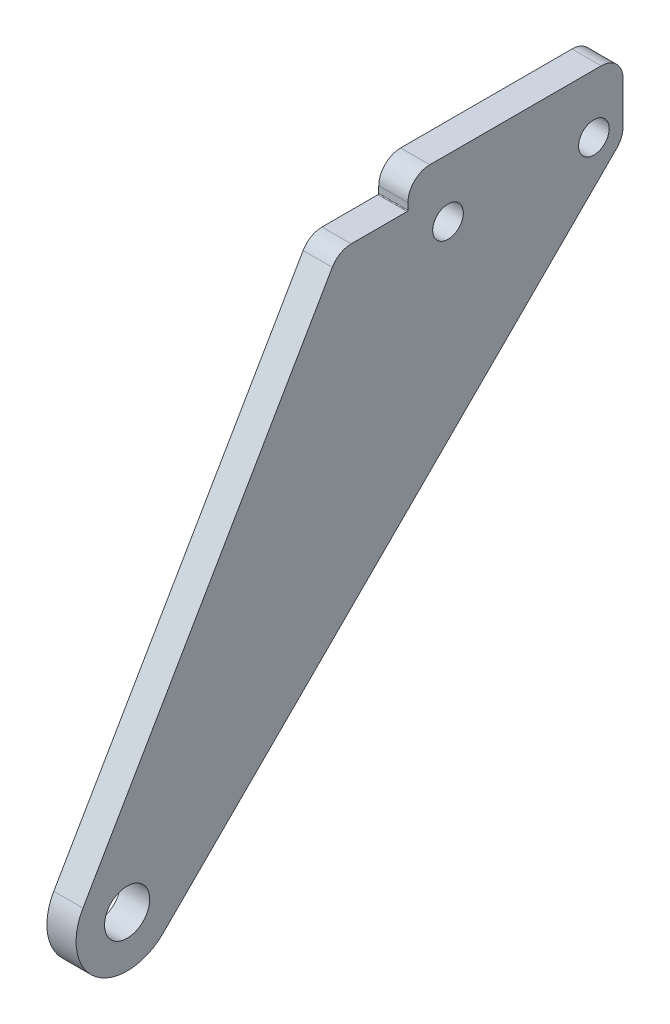
ISO-10303-21;
HEADER;
FILE_DESCRIPTION(('STEP AP214'),'2;1');
FILE_NAME('part.step','',(''),(''),'','','');
FILE_SCHEMA(('AUTOMOTIVE_DESIGN { 1 0 10303 214 1 1 1 1 }'));
ENDSEC;
DATA;
#1=APPLICATION_CONTEXT('core data for automotive mechanical design processes');
#2=APPLICATION_PROTOCOL_DEFINITION('international standard','automotive_design',2000,#1);
#3=PRODUCT_CONTEXT('',#1,'mechanical');
#4=PRODUCT('Part','Part','',(#3));
#5=PRODUCT_RELATED_PRODUCT_CATEGORY('part','',(#4));
#6=PRODUCT_DEFINITION_FORMATION('','',#4);
#7=PRODUCT_DEFINITION_CONTEXT('part definition',#1,'design');
#8=PRODUCT_DEFINITION('design','',#6,#7);
#9=PRODUCT_DEFINITION_SHAPE('','',#8);
#10=(LENGTH_UNIT() NAMED_UNIT(*) SI_UNIT(.MILLI.,.METRE.));
#11=(NAMED_UNIT(*) PLANE_ANGLE_UNIT() SI_UNIT($,.RADIAN.));
#12=(NAMED_UNIT(*) SI_UNIT($,.STERADIAN.) SOLID_ANGLE_UNIT());
#13=UNCERTAINTY_MEASURE_WITH_UNIT(LENGTH_MEASURE(1.E-05),#10,'distance_accuracy_value','');
#14=(GEOMETRIC_REPRESENTATION_CONTEXT(3) GLOBAL_UNCERTAINTY_ASSIGNED_CONTEXT((#13)) GLOBAL_UNIT_ASSIGNED_CONTEXT((#10,
#11,#12)) REPRESENTATION_CONTEXT('',''));
#15=CARTESIAN_POINT('',(0.,0.,0.));
#16=DIRECTION('',(0.,0.,1.));
#17=DIRECTION('',(1.,0.,0.));
#18=AXIS2_PLACEMENT_3D('',#15,#16,#17);
#19=CARTESIAN_POINT('',(4.,64.,-29.));
#20=DIRECTION('',(0.,-1.,0.));
#21=DIRECTION('',(0.,0.,-1.));
#22=AXIS2_PLACEMENT_3D('',#19,#20,#21);
#23=PLANE('',#22);
#24=DIRECTION('',(0.,0.,1.));
#25=VECTOR('',#24,1.);
#26=CARTESIAN_POINT('',(4.,64.,-29.));
#27=LINE('',#26,#25);
#28=CARTESIAN_POINT('',(4.,64.,-38.4));
#29=VERTEX_POINT('',#28);
#30=CARTESIAN_POINT('',(4.,64.,-30.7287704157096));
#31=VERTEX_POINT('',#30);
#32=EDGE_CURVE('E131',#29,#31,#27,.T.);
#33=ORIENTED_EDGE('',*,*,#32,.F.);
#34=DIRECTION('',(1.,0.,0.));
#35=VECTOR('',#34,1.);
#36=CARTESIAN_POINT('',(4.,64.,-38.4));
#37=LINE('',#36,#35);
#38=CARTESIAN_POINT('',(0.,64.,-38.4));
#39=VERTEX_POINT('',#38);
#40=EDGE_CURVE('E55',#29,#39,#37,.F.);
#41=ORIENTED_EDGE('',*,*,#40,.T.);
#42=DIRECTION('',(0.,0.,1.));
#43=VECTOR('',#42,1.);
#44=CARTESIAN_POINT('',(0.,64.,-29.));
#45=LINE('',#44,#43);
#46=CARTESIAN_POINT('',(0.,64.,-30.7287704157096));
#47=VERTEX_POINT('',#46);
#48=EDGE_CURVE('E235',#39,#47,#45,.T.);
#49=ORIENTED_EDGE('',*,*,#48,.T.);
#50=DIRECTION('',(-1.,0.,0.));
#51=VECTOR('',#50,1.);
#52=CARTESIAN_POINT('',(4.,64.,-30.7287704157096));
#53=LINE('',#52,#51);
#54=EDGE_CURVE('E181',#47,#31,#53,.F.);
#55=ORIENTED_EDGE('',*,*,#54,.T.);
#56=EDGE_LOOP('',(#33,#41,#49,#55));
#57=FACE_BOUND('',#56,.T.);
#58=ADVANCED_FACE('F34',(#57),#23,.F.);
#59=CARTESIAN_POINT('',(4.,0.,0.));
#60=DIRECTION('',(1.,0.,0.));
#61=DIRECTION('',(0.,0.,-1.));
#62=AXIS2_PLACEMENT_3D('',#59,#60,#61);
#63=PLANE('',#62);
#64=DIRECTION('',(0.,0.,1.));
#65=VECTOR('',#64,1.);
#66=CARTESIAN_POINT('',(4.,68.,-74.));
#67=LINE('',#66,#65);
#68=CARTESIAN_POINT('',(4.,68.,-65.));
#69=VERTEX_POINT('',#68);
#70=CARTESIAN_POINT('',(4.,68.,-41.5));
#71=VERTEX_POINT('',#70);
#72=EDGE_CURVE('E203',#69,#71,#67,.T.);
#73=ORIENTED_EDGE('',*,*,#72,.T.);
#74=CARTESIAN_POINT('',(4.,65.,-41.5));
#75=DIRECTION('',(1.,0.,0.));
#76=DIRECTION('',(0.,0.,-1.));
#77=AXIS2_PLACEMENT_3D('',#74,#75,#76);
#78=CIRCLE('',#77,3.);
#79=CARTESIAN_POINT('',(4.,65.,-38.5));
#80=VERTEX_POINT('',#79);
#81=EDGE_CURVE('E164',#71,#80,#78,.T.);
#82=ORIENTED_EDGE('',*,*,#81,.T.);
#83=DIRECTION('',(0.,-1.,0.));
#84=VECTOR('',#83,1.);
#85=CARTESIAN_POINT('',(4.,64.,-38.5));
#86=LINE('',#85,#84);
#87=CARTESIAN_POINT('',(4.,64.1,-38.5));
#88=VERTEX_POINT('',#87);
#89=EDGE_CURVE('E198',#80,#88,#86,.T.);
#90=ORIENTED_EDGE('',*,*,#89,.T.);
#91=CARTESIAN_POINT('',(4.,64.1,-38.4));
#92=DIRECTION('',(1.,0.,0.));
#93=DIRECTION('',(0.,0.,-1.));
#94=AXIS2_PLACEMENT_3D('',#91,#92,#93);
#95=CIRCLE('',#94,0.1);
#96=EDGE_CURVE('E42',#88,#29,#95,.F.);
#97=ORIENTED_EDGE('',*,*,#96,.T.);
#98=ORIENTED_EDGE('',*,*,#32,.T.);
#99=CARTESIAN_POINT('',(4.,61.,-30.7287704157096));
#100=DIRECTION('',(1.,0.,0.));
#101=DIRECTION('',(0.,0.,-1.));
#102=AXIS2_PLACEMENT_3D('',#99,#100,#101);
#103=CIRCLE('',#102,3.);
#104=CARTESIAN_POINT('',(4.,62.5042613502018,-28.1331591600919));
#105=VERTEX_POINT('',#104);
#106=EDGE_CURVE('E162',#31,#105,#103,.T.);
#107=ORIENTED_EDGE('',*,*,#106,.T.);
#108=DIRECTION('',(0.,-0.865203751872559,0.501420450067253));
#109=VECTOR('',#108,1.);
#110=CARTESIAN_POINT('',(4.,3.50994315047077,6.05642626310791));
#111=LINE('',#110,#109);
#112=CARTESIAN_POINT('',(4.,3.50994315047077,6.05642626310791));
#113=VERTEX_POINT('',#112);
#114=EDGE_CURVE('E139',#105,#113,#111,.T.);
#115=ORIENTED_EDGE('',*,*,#114,.T.);
#116=CARTESIAN_POINT('',(4.,0.,0.));
#117=DIRECTION('',(1.,0.,0.));
#118=DIRECTION('',(0.,0.,-1.));
#119=AXIS2_PLACEMENT_3D('',#116,#117,#118);
#120=CIRCLE('',#119,7.);
#121=CARTESIAN_POINT('',(4.,-4.95335094954734,-4.94614136177067));
#122=VERTEX_POINT('',#121);
#123=EDGE_CURVE('E132',#113,#122,#120,.T.);
#124=ORIENTED_EDGE('',*,*,#123,.T.);
#125=DIRECTION('',(0.,0.706591623110095,-0.707621564221047));
#126=VECTOR('',#125,1.);
#127=CARTESIAN_POINT('',(4.,64.,-74.));
#128=LINE('',#127,#126);
#129=CARTESIAN_POINT('',(4.,57.1297890168252,-67.1197748693303));
#130=VERTEX_POINT('',#129);
#131=EDGE_CURVE('E122',#122,#130,#128,.T.);
#132=ORIENTED_EDGE('',*,*,#131,.T.);
#133=CARTESIAN_POINT('',(4.,59.2526537094883,-65.));
#134=DIRECTION('',(1.,0.,0.));
#135=DIRECTION('',(0.,0.,-1.));
#136=AXIS2_PLACEMENT_3D('',#133,#134,#135);
#137=CIRCLE('',#136,3.);
#138=CARTESIAN_POINT('',(4.,59.2526537094883,-68.));
#139=VERTEX_POINT('',#138);
#140=EDGE_CURVE('E160',#130,#139,#137,.T.);
#141=ORIENTED_EDGE('',*,*,#140,.T.);
#142=DIRECTION('',(0.,-1.,0.));
#143=VECTOR('',#142,1.);
#144=CARTESIAN_POINT('',(4.,68.,-68.));
#145=LINE('',#144,#143);
#146=CARTESIAN_POINT('',(4.,65.,-68.));
#147=VERTEX_POINT('',#146);
#148=EDGE_CURVE('E250',#147,#139,#145,.T.);
#149=ORIENTED_EDGE('',*,*,#148,.F.);
#150=CARTESIAN_POINT('',(4.,65.,-65.));
#151=DIRECTION('',(1.,0.,0.));
#152=DIRECTION('',(0.,0.,-1.));
#153=AXIS2_PLACEMENT_3D('',#150,#151,#152);
#154=CIRCLE('',#153,3.);
#155=EDGE_CURVE('E158',#147,#69,#154,.T.);
#156=ORIENTED_EDGE('',*,*,#155,.T.);
#157=EDGE_LOOP('',(#73,#82,#90,#97,#98,#107,#115,#124,#132,#141,#149,#156));
#158=FACE_BOUND('',#157,.T.);
#159=CARTESIAN_POINT('',(4.,60.,-44.));
#160=DIRECTION('',(1.,0.,0.));
#161=DIRECTION('',(0.,0.,-1.));
#162=AXIS2_PLACEMENT_3D('',#159,#160,#161);
#163=CIRCLE('',#162,2.1);
#164=CARTESIAN_POINT('',(4.,60.,-46.1));
#165=VERTEX_POINT('',#164);
#166=EDGE_CURVE('E219',#165,#165,#163,.T.);
#167=ORIENTED_EDGE('',*,*,#166,.F.);
#168=EDGE_LOOP('',(#167));
#169=FACE_BOUND('',#168,.T.);
#170=CARTESIAN_POINT('',(4.,0.,0.));
#171=DIRECTION('',(1.,0.,0.));
#172=DIRECTION('',(0.,0.,-1.));
#173=AXIS2_PLACEMENT_3D('',#170,#171,#172);
#174=CIRCLE('',#173,3.1);
#175=CARTESIAN_POINT('',(4.,0.,-3.1));
#176=VERTEX_POINT('',#175);
#177=EDGE_CURVE('E225',#176,#176,#174,.T.);
#178=ORIENTED_EDGE('',*,*,#177,.F.);
#179=EDGE_LOOP('',(#178));
#180=FACE_BOUND('',#179,.T.);
#181=CARTESIAN_POINT('',(4.,60.,-64.));
#182=DIRECTION('',(1.,0.,0.));
#183=DIRECTION('',(0.,0.,-1.));
#184=AXIS2_PLACEMENT_3D('',#181,#182,#183);
#185=CIRCLE('',#184,2.09999999999999);
#186=CARTESIAN_POINT('',(4.,60.,-66.1));
#187=VERTEX_POINT('',#186);
#188=EDGE_CURVE('E213',#187,#187,#185,.T.);
#189=ORIENTED_EDGE('',*,*,#188,.F.);
#190=EDGE_LOOP('',(#189));
#191=FACE_BOUND('',#190,.T.);
#192=ADVANCED_FACE('F136',(#158,#169,#180,#191),#63,.T.);
#193=CARTESIAN_POINT('',(0.,0.,0.));
#194=DIRECTION('',(1.,0.,0.));
#195=DIRECTION('',(0.,0.,-1.));
#196=AXIS2_PLACEMENT_3D('',#193,#194,#195);
#197=PLANE('',#196);
#198=ORIENTED_EDGE('',*,*,#48,.F.);
#199=CARTESIAN_POINT('',(0.,64.1,-38.4));
#200=DIRECTION('',(1.,0.,0.));
#201=DIRECTION('',(0.,0.,-1.));
#202=AXIS2_PLACEMENT_3D('',#199,#200,#201);
#203=CIRCLE('',#202,0.1);
#204=CARTESIAN_POINT('',(0.,64.1,-38.5));
#205=VERTEX_POINT('',#204);
#206=EDGE_CURVE('E11',#39,#205,#203,.T.);
#207=ORIENTED_EDGE('',*,*,#206,.T.);
#208=DIRECTION('',(0.,1.,0.));
#209=VECTOR('',#208,1.);
#210=CARTESIAN_POINT('',(0.,64.,-38.5));
#211=LINE('',#210,#209);
#212=CARTESIAN_POINT('',(0.,65.,-38.5));
#213=VERTEX_POINT('',#212);
#214=EDGE_CURVE('E200',#205,#213,#211,.T.);
#215=ORIENTED_EDGE('',*,*,#214,.T.);
#216=CARTESIAN_POINT('',(0.,65.,-41.5));
#217=DIRECTION('',(1.,0.,0.));
#218=DIRECTION('',(0.,0.,-1.));
#219=AXIS2_PLACEMENT_3D('',#216,#217,#218);
#220=CIRCLE('',#219,3.);
#221=CARTESIAN_POINT('',(0.,68.,-41.5));
#222=VERTEX_POINT('',#221);
#223=EDGE_CURVE('E176',#213,#222,#220,.F.);
#224=ORIENTED_EDGE('',*,*,#223,.T.);
#225=DIRECTION('',(0.,0.,-1.));
#226=VECTOR('',#225,1.);
#227=CARTESIAN_POINT('',(0.,68.,-74.));
#228=LINE('',#227,#226);
#229=CARTESIAN_POINT('',(0.,68.,-65.));
#230=VERTEX_POINT('',#229);
#231=EDGE_CURVE('E205',#222,#230,#228,.T.);
#232=ORIENTED_EDGE('',*,*,#231,.T.);
#233=CARTESIAN_POINT('',(0.,65.,-65.));
#234=DIRECTION('',(1.,0.,0.));
#235=DIRECTION('',(0.,0.,-1.));
#236=AXIS2_PLACEMENT_3D('',#233,#234,#235);
#237=CIRCLE('',#236,3.);
#238=CARTESIAN_POINT('',(0.,65.,-68.));
#239=VERTEX_POINT('',#238);
#240=EDGE_CURVE('E169',#230,#239,#237,.F.);
#241=ORIENTED_EDGE('',*,*,#240,.T.);
#242=DIRECTION('',(0.,-1.,0.));
#243=VECTOR('',#242,1.);
#244=CARTESIAN_POINT('',(0.,68.,-68.));
#245=LINE('',#244,#243);
#246=CARTESIAN_POINT('',(0.,59.2526537094883,-68.));
#247=VERTEX_POINT('',#246);
#248=EDGE_CURVE('E207',#239,#247,#245,.T.);
#249=ORIENTED_EDGE('',*,*,#248,.T.);
#250=CARTESIAN_POINT('',(0.,59.2526537094883,-65.));
#251=DIRECTION('',(1.,0.,0.));
#252=DIRECTION('',(0.,0.,-1.));
#253=AXIS2_PLACEMENT_3D('',#250,#251,#252);
#254=CIRCLE('',#253,3.);
#255=CARTESIAN_POINT('',(0.,57.1297890168252,-67.1197748693303));
#256=VERTEX_POINT('',#255);
#257=EDGE_CURVE('E171',#247,#256,#254,.F.);
#258=ORIENTED_EDGE('',*,*,#257,.T.);
#259=DIRECTION('',(0.,0.706591623110095,-0.707621564221047));
#260=VECTOR('',#259,1.);
#261=CARTESIAN_POINT('',(0.,64.,-74.));
#262=LINE('',#261,#260);
#263=CARTESIAN_POINT('',(0.,-4.95335094954734,-4.94614136177067));
#264=VERTEX_POINT('',#263);
#265=EDGE_CURVE('E233',#264,#256,#262,.T.);
#266=ORIENTED_EDGE('',*,*,#265,.F.);
#267=CARTESIAN_POINT('',(0.,0.,0.));
#268=DIRECTION('',(1.,0.,0.));
#269=DIRECTION('',(0.,0.,-1.));
#270=AXIS2_PLACEMENT_3D('',#267,#268,#269);
#271=CIRCLE('',#270,7.);
#272=CARTESIAN_POINT('',(0.,3.50994315047077,6.05642626310791));
#273=VERTEX_POINT('',#272);
#274=EDGE_CURVE('E147',#273,#264,#271,.T.);
#275=ORIENTED_EDGE('',*,*,#274,.F.);
#276=DIRECTION('',(0.,-0.865203751872559,0.501420450067253));
#277=VECTOR('',#276,1.);
#278=CARTESIAN_POINT('',(0.,3.50994315047077,6.05642626310791));
#279=LINE('',#278,#277);
#280=CARTESIAN_POINT('',(0.,62.5042613502018,-28.1331591600919));
#281=VERTEX_POINT('',#280);
#282=EDGE_CURVE('E143',#281,#273,#279,.T.);
#283=ORIENTED_EDGE('',*,*,#282,.F.);
#284=CARTESIAN_POINT('',(0.,61.,-30.7287704157096));
#285=DIRECTION('',(1.,0.,0.));
#286=DIRECTION('',(0.,0.,-1.));
#287=AXIS2_PLACEMENT_3D('',#284,#285,#286);
#288=CIRCLE('',#287,3.);
#289=EDGE_CURVE('E173',#281,#47,#288,.F.);
#290=ORIENTED_EDGE('',*,*,#289,.T.);
#291=EDGE_LOOP('',(#198,#207,#215,#224,#232,#241,#249,#258,#266,#275,#283,#290));
#292=FACE_BOUND('',#291,.T.);
#293=CARTESIAN_POINT('',(0.,0.,0.));
#294=DIRECTION('',(1.,0.,0.));
#295=DIRECTION('',(0.,0.,-1.));
#296=AXIS2_PLACEMENT_3D('',#293,#294,#295);
#297=CIRCLE('',#296,3.1);
#298=CARTESIAN_POINT('',(0.,0.,-3.1));
#299=VERTEX_POINT('',#298);
#300=EDGE_CURVE('E222',#299,#299,#297,.T.);
#301=ORIENTED_EDGE('',*,*,#300,.T.);
#302=EDGE_LOOP('',(#301));
#303=FACE_BOUND('',#302,.T.);
#304=CARTESIAN_POINT('',(0.,60.,-44.));
#305=DIRECTION('',(1.,0.,0.));
#306=DIRECTION('',(0.,0.,-1.));
#307=AXIS2_PLACEMENT_3D('',#304,#305,#306);
#308=CIRCLE('',#307,2.1);
#309=CARTESIAN_POINT('',(0.,60.,-46.1));
#310=VERTEX_POINT('',#309);
#311=EDGE_CURVE('E216',#310,#310,#308,.T.);
#312=ORIENTED_EDGE('',*,*,#311,.T.);
#313=EDGE_LOOP('',(#312));
#314=FACE_BOUND('',#313,.T.);
#315=CARTESIAN_POINT('',(0.,60.,-64.));
#316=DIRECTION('',(1.,0.,0.));
#317=DIRECTION('',(0.,0.,-1.));
#318=AXIS2_PLACEMENT_3D('',#315,#316,#317);
#319=CIRCLE('',#318,2.09999999999999);
#320=CARTESIAN_POINT('',(0.,60.,-66.1));
#321=VERTEX_POINT('',#320);
#322=EDGE_CURVE('E212',#321,#321,#319,.T.);
#323=ORIENTED_EDGE('',*,*,#322,.T.);
#324=EDGE_LOOP('',(#323));
#325=FACE_BOUND('',#324,.T.);
#326=ADVANCED_FACE('F241',(#292,#303,#314,#325),#197,.F.);
#327=CARTESIAN_POINT('',(4.,0.,0.));
#328=DIRECTION('',(-1.,0.,0.));
#329=DIRECTION('',(0.,0.,1.));
#330=AXIS2_PLACEMENT_3D('',#327,#328,#329);
#331=CYLINDRICAL_SURFACE('',#330,7.);
#332=ORIENTED_EDGE('',*,*,#274,.T.);
#333=DIRECTION('',(-1.,0.,0.));
#334=VECTOR('',#333,1.);
#335=CARTESIAN_POINT('',(4.,-4.95335094954734,-4.94614136177067));
#336=LINE('',#335,#334);
#337=EDGE_CURVE('E127',#122,#264,#336,.T.);
#338=ORIENTED_EDGE('',*,*,#337,.F.);
#339=ORIENTED_EDGE('',*,*,#123,.F.);
#340=DIRECTION('',(-1.,0.,0.));
#341=VECTOR('',#340,1.);
#342=CARTESIAN_POINT('',(4.,3.50994315047077,6.05642626310791));
#343=LINE('',#342,#341);
#344=EDGE_CURVE('E149',#113,#273,#343,.T.);
#345=ORIENTED_EDGE('',*,*,#344,.T.);
#346=EDGE_LOOP('',(#332,#338,#339,#345));
#347=FACE_BOUND('',#346,.T.);
#348=ADVANCED_FACE('F145',(#347),#331,.T.);
#349=CARTESIAN_POINT('',(4.,64.,-74.));
#350=DIRECTION('',(0.,0.707621564221047,0.706591623110095));
#351=DIRECTION('',(0.,-0.706591623110095,0.707621564221047));
#352=AXIS2_PLACEMENT_3D('',#349,#350,#351);
#353=PLANE('',#352);
#354=ORIENTED_EDGE('',*,*,#265,.T.);
#355=DIRECTION('',(1.,0.,0.));
#356=VECTOR('',#355,1.);
#357=CARTESIAN_POINT('',(4.,57.1297890168252,-67.1197748693303));
#358=LINE('',#357,#356);
#359=EDGE_CURVE('E130',#256,#130,#358,.T.);
#360=ORIENTED_EDGE('',*,*,#359,.T.);
#361=ORIENTED_EDGE('',*,*,#131,.F.);
#362=ORIENTED_EDGE('',*,*,#337,.T.);
#363=EDGE_LOOP('',(#354,#360,#361,#362));
#364=FACE_BOUND('',#363,.T.);
#365=ADVANCED_FACE('F125',(#364),#353,.F.);
#366=CARTESIAN_POINT('',(4.,3.50994315047077,6.05642626310791));
#367=DIRECTION('',(0.,-0.501420450067253,-0.865203751872559));
#368=DIRECTION('',(0.,0.865203751872559,-0.501420450067253));
#369=AXIS2_PLACEMENT_3D('',#366,#367,#368);
#370=PLANE('',#369);
#371=ORIENTED_EDGE('',*,*,#114,.F.);
#372=DIRECTION('',(-1.,0.,0.));
#373=VECTOR('',#372,1.);
#374=CARTESIAN_POINT('',(4.,62.5042613502018,-28.1331591600919));
#375=LINE('',#374,#373);
#376=EDGE_CURVE('E178',#105,#281,#375,.T.);
#377=ORIENTED_EDGE('',*,*,#376,.T.);
#378=ORIENTED_EDGE('',*,*,#282,.T.);
#379=ORIENTED_EDGE('',*,*,#344,.F.);
#380=EDGE_LOOP('',(#371,#377,#378,#379));
#381=FACE_BOUND('',#380,.T.);
#382=ADVANCED_FACE('F238',(#381),#370,.F.);
#383=CARTESIAN_POINT('',(4.,0.,0.));
#384=DIRECTION('',(-1.,0.,0.));
#385=DIRECTION('',(0.,0.,1.));
#386=AXIS2_PLACEMENT_3D('',#383,#384,#385);
#387=CYLINDRICAL_SURFACE('',#386,3.1);
#388=ORIENTED_EDGE('',*,*,#177,.T.);
#389=EDGE_LOOP('',(#388));
#390=FACE_BOUND('',#389,.T.);
#391=ORIENTED_EDGE('',*,*,#300,.F.);
#392=EDGE_LOOP('',(#391));
#393=FACE_BOUND('',#392,.T.);
#394=ADVANCED_FACE('F376',(#390,#393),#387,.F.);
#395=CARTESIAN_POINT('',(4.,60.,-44.));
#396=DIRECTION('',(-1.,0.,0.));
#397=DIRECTION('',(0.,0.,1.));
#398=AXIS2_PLACEMENT_3D('',#395,#396,#397);
#399=CYLINDRICAL_SURFACE('',#398,2.1);
#400=ORIENTED_EDGE('',*,*,#166,.T.);
#401=EDGE_LOOP('',(#400));
#402=FACE_BOUND('',#401,.T.);
#403=ORIENTED_EDGE('',*,*,#311,.F.);
#404=EDGE_LOOP('',(#403));
#405=FACE_BOUND('',#404,.T.);
#406=ADVANCED_FACE('F373',(#402,#405),#399,.F.);
#407=CARTESIAN_POINT('',(4.,60.,-64.));
#408=DIRECTION('',(-1.,0.,0.));
#409=DIRECTION('',(0.,0.,1.));
#410=AXIS2_PLACEMENT_3D('',#407,#408,#409);
#411=CYLINDRICAL_SURFACE('',#410,2.09999999999999);
#412=ORIENTED_EDGE('',*,*,#188,.T.);
#413=EDGE_LOOP('',(#412));
#414=FACE_BOUND('',#413,.T.);
#415=ORIENTED_EDGE('',*,*,#322,.F.);
#416=EDGE_LOOP('',(#415));
#417=FACE_BOUND('',#416,.T.);
#418=ADVANCED_FACE('F330',(#414,#417),#411,.F.);
#419=CARTESIAN_POINT('',(-35.7246413557925,64.,-38.5));
#420=DIRECTION('',(0.,0.,1.));
#421=DIRECTION('',(1.,0.,0.));
#422=AXIS2_PLACEMENT_3D('',#419,#420,#421);
#423=PLANE('',#422);
#424=ORIENTED_EDGE('',*,*,#214,.F.);
#425=DIRECTION('',(1.,0.,0.));
#426=VECTOR('',#425,1.);
#427=CARTESIAN_POINT('',(-35.7246413557925,64.1,-38.5));
#428=LINE('',#427,#426);
#429=EDGE_CURVE('E190',#205,#88,#428,.T.);
#430=ORIENTED_EDGE('',*,*,#429,.T.);
#431=ORIENTED_EDGE('',*,*,#89,.F.);
#432=DIRECTION('',(1.,0.,0.));
#433=VECTOR('',#432,1.);
#434=CARTESIAN_POINT('',(-35.7246413557925,65.,-38.5));
#435=LINE('',#434,#433);
#436=EDGE_CURVE('E166',#80,#213,#435,.F.);
#437=ORIENTED_EDGE('',*,*,#436,.T.);
#438=EDGE_LOOP('',(#424,#430,#431,#437));
#439=FACE_BOUND('',#438,.T.);
#440=ADVANCED_FACE('F197',(#439),#423,.T.);
#441=CARTESIAN_POINT('',(-35.7246413557925,68.,-74.));
#442=DIRECTION('',(0.,1.,0.));
#443=DIRECTION('',(0.,0.,1.));
#444=AXIS2_PLACEMENT_3D('',#441,#442,#443);
#445=PLANE('',#444);
#446=ORIENTED_EDGE('',*,*,#231,.F.);
#447=DIRECTION('',(1.,0.,0.));
#448=VECTOR('',#447,1.);
#449=CARTESIAN_POINT('',(-35.7246413557925,68.,-41.5));
#450=LINE('',#449,#448);
#451=EDGE_CURVE('E151',#222,#71,#450,.T.);
#452=ORIENTED_EDGE('',*,*,#451,.T.);
#453=ORIENTED_EDGE('',*,*,#72,.F.);
#454=DIRECTION('',(1.,0.,0.));
#455=VECTOR('',#454,1.);
#456=CARTESIAN_POINT('',(0.,68.,-65.));
#457=LINE('',#456,#455);
#458=EDGE_CURVE('E148',#69,#230,#457,.F.);
#459=ORIENTED_EDGE('',*,*,#458,.T.);
#460=EDGE_LOOP('',(#446,#452,#453,#459));
#461=FACE_BOUND('',#460,.T.);
#462=ADVANCED_FACE('F264',(#461),#445,.T.);
#463=CARTESIAN_POINT('',(0.,68.,-68.));
#464=DIRECTION('',(0.,0.,1.));
#465=DIRECTION('',(1.,0.,0.));
#466=AXIS2_PLACEMENT_3D('',#463,#464,#465);
#467=PLANE('',#466);
#468=ORIENTED_EDGE('',*,*,#148,.T.);
#469=DIRECTION('',(1.,0.,0.));
#470=VECTOR('',#469,1.);
#471=CARTESIAN_POINT('',(0.,59.2526537094883,-68.));
#472=LINE('',#471,#470);
#473=EDGE_CURVE('E188',#139,#247,#472,.F.);
#474=ORIENTED_EDGE('',*,*,#473,.T.);
#475=ORIENTED_EDGE('',*,*,#248,.F.);
#476=DIRECTION('',(1.,0.,0.));
#477=VECTOR('',#476,1.);
#478=CARTESIAN_POINT('',(4.,65.,-68.));
#479=LINE('',#478,#477);
#480=EDGE_CURVE('E185',#239,#147,#479,.T.);
#481=ORIENTED_EDGE('',*,*,#480,.T.);
#482=EDGE_LOOP('',(#468,#474,#475,#481));
#483=FACE_BOUND('',#482,.T.);
#484=ADVANCED_FACE('F252',(#483),#467,.F.);
#485=CARTESIAN_POINT('',(-35.7246413557925,65.,-41.5));
#486=DIRECTION('',(1.,0.,0.));
#487=DIRECTION('',(0.,0.,-1.));
#488=AXIS2_PLACEMENT_3D('',#485,#486,#487);
#489=CYLINDRICAL_SURFACE('',#488,3.);
#490=ORIENTED_EDGE('',*,*,#223,.F.);
#491=ORIENTED_EDGE('',*,*,#436,.F.);
#492=ORIENTED_EDGE('',*,*,#81,.F.);
#493=ORIENTED_EDGE('',*,*,#451,.F.);
#494=EDGE_LOOP('',(#490,#491,#492,#493));
#495=FACE_BOUND('',#494,.T.);
#496=ADVANCED_FACE('F268',(#495),#489,.T.);
#497=CARTESIAN_POINT('',(4.,61.,-30.7287704157096));
#498=DIRECTION('',(-1.,0.,0.));
#499=DIRECTION('',(0.,0.,1.));
#500=AXIS2_PLACEMENT_3D('',#497,#498,#499);
#501=CYLINDRICAL_SURFACE('',#500,3.);
#502=ORIENTED_EDGE('',*,*,#106,.F.);
#503=ORIENTED_EDGE('',*,*,#54,.F.);
#504=ORIENTED_EDGE('',*,*,#289,.F.);
#505=ORIENTED_EDGE('',*,*,#376,.F.);
#506=EDGE_LOOP('',(#502,#503,#504,#505));
#507=FACE_BOUND('',#506,.T.);
#508=ADVANCED_FACE('F288',(#507),#501,.T.);
#509=CARTESIAN_POINT('',(4.,59.2526537094883,-65.));
#510=DIRECTION('',(1.,0.,0.));
#511=DIRECTION('',(0.,0.,-1.));
#512=AXIS2_PLACEMENT_3D('',#509,#510,#511);
#513=CYLINDRICAL_SURFACE('',#512,3.);
#514=ORIENTED_EDGE('',*,*,#257,.F.);
#515=ORIENTED_EDGE('',*,*,#473,.F.);
#516=ORIENTED_EDGE('',*,*,#140,.F.);
#517=ORIENTED_EDGE('',*,*,#359,.F.);
#518=EDGE_LOOP('',(#514,#515,#516,#517));
#519=FACE_BOUND('',#518,.T.);
#520=ADVANCED_FACE('F246',(#519),#513,.T.);
#521=CARTESIAN_POINT('',(0.,65.,-65.));
#522=DIRECTION('',(-1.,0.,0.));
#523=DIRECTION('',(0.,0.,1.));
#524=AXIS2_PLACEMENT_3D('',#521,#522,#523);
#525=CYLINDRICAL_SURFACE('',#524,3.);
#526=ORIENTED_EDGE('',*,*,#240,.F.);
#527=ORIENTED_EDGE('',*,*,#458,.F.);
#528=ORIENTED_EDGE('',*,*,#155,.F.);
#529=ORIENTED_EDGE('',*,*,#480,.F.);
#530=EDGE_LOOP('',(#526,#527,#528,#529));
#531=FACE_BOUND('',#530,.T.);
#532=ADVANCED_FACE('F259',(#531),#525,.T.);
#533=CARTESIAN_POINT('',(-35.7246413557925,64.1,-38.4));
#534=DIRECTION('',(1.,0.,0.));
#535=DIRECTION('',(0.,0.,-1.));
#536=AXIS2_PLACEMENT_3D('',#533,#534,#535);
#537=CYLINDRICAL_SURFACE('',#536,0.1);
#538=ORIENTED_EDGE('',*,*,#206,.F.);
#539=ORIENTED_EDGE('',*,*,#40,.F.);
#540=ORIENTED_EDGE('',*,*,#96,.F.);
#541=ORIENTED_EDGE('',*,*,#429,.F.);
#542=EDGE_LOOP('',(#538,#539,#540,#541));
#543=FACE_BOUND('',#542,.T.);
#544=ADVANCED_FACE('F36',(#543),#537,.F.);
#545=CLOSED_SHELL('',(#58,#192,#326,#348,#365,#382,#394,#406,#418,#440,#462,#484,#496,#508,#520,
#532,#544));
#546=MANIFOLD_SOLID_BREP('B2',#545);
#547=ADVANCED_BREP_SHAPE_REPRESENTATION('',(#18,#546),#14);
#548=SHAPE_DEFINITION_REPRESENTATION(#9,#547);
ENDSEC;
END-ISO-10303-21;
